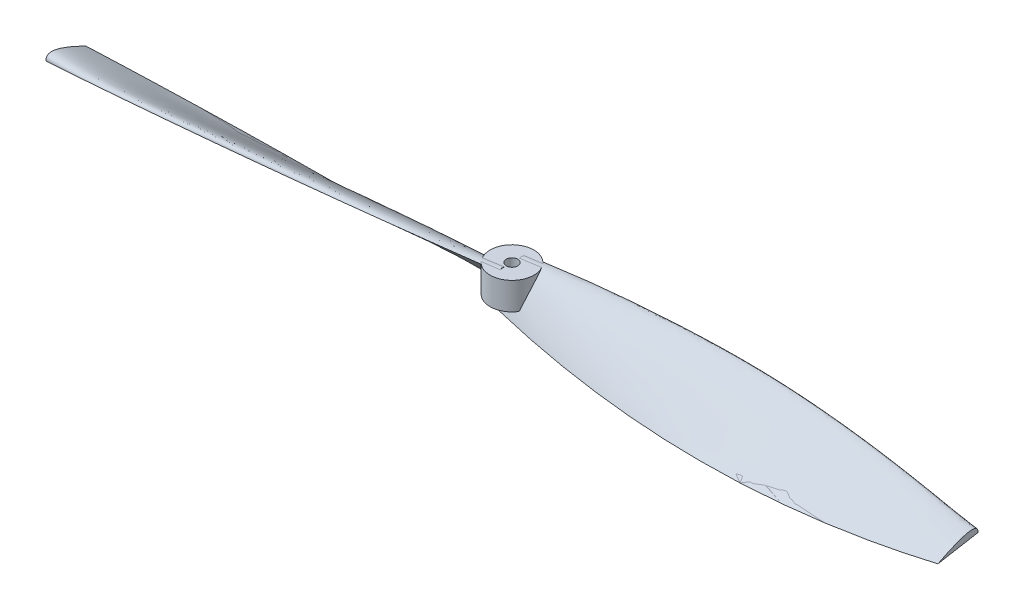
ISO-10303-21;
HEADER;
FILE_DESCRIPTION(('STEP AP214'),'2;1');
FILE_NAME('part.step','',(''),(''),'','','');
FILE_SCHEMA(('AUTOMOTIVE_DESIGN { 1 0 10303 214 1 1 1 1 }'));
ENDSEC;
DATA;
#1=APPLICATION_CONTEXT('core data for automotive mechanical design processes');
#2=APPLICATION_PROTOCOL_DEFINITION('international standard','automotive_design',2000,#1);
#3=PRODUCT_CONTEXT('',#1,'mechanical');
#4=PRODUCT('Part','Part','',(#3));
#5=PRODUCT_RELATED_PRODUCT_CATEGORY('part','',(#4));
#6=PRODUCT_DEFINITION_FORMATION('','',#4);
#7=PRODUCT_DEFINITION_CONTEXT('part definition',#1,'design');
#8=PRODUCT_DEFINITION('design','',#6,#7);
#9=PRODUCT_DEFINITION_SHAPE('','',#8);
#10=(LENGTH_UNIT() NAMED_UNIT(*) SI_UNIT(.MILLI.,.METRE.));
#11=(NAMED_UNIT(*) PLANE_ANGLE_UNIT() SI_UNIT($,.RADIAN.));
#12=(NAMED_UNIT(*) SI_UNIT($,.STERADIAN.) SOLID_ANGLE_UNIT());
#13=UNCERTAINTY_MEASURE_WITH_UNIT(LENGTH_MEASURE(1.E-05),#10,'distance_accuracy_value','');
#14=(GEOMETRIC_REPRESENTATION_CONTEXT(3) GLOBAL_UNCERTAINTY_ASSIGNED_CONTEXT((#13)) GLOBAL_UNIT_ASSIGNED_CONTEXT((#10,
#11,#12)) REPRESENTATION_CONTEXT('',''));
#15=CARTESIAN_POINT('',(0.,0.,0.));
#16=DIRECTION('',(0.,0.,1.));
#17=DIRECTION('',(1.,0.,0.));
#18=AXIS2_PLACEMENT_3D('',#15,#16,#17);
#19=CARTESIAN_POINT('',(0.,14.25,0.));
#20=DIRECTION('',(0.,-1.,0.));
#21=DIRECTION('',(0.,0.,-1.));
#22=AXIS2_PLACEMENT_3D('',#19,#20,#21);
#23=CYLINDRICAL_SURFACE('',#22,6.);
#24=CARTESIAN_POINT('',(0.,6.74999999999999,0.));
#25=DIRECTION('',(0.,1.,0.));
#26=DIRECTION('',(0.,0.,1.));
#27=AXIS2_PLACEMENT_3D('',#24,#25,#26);
#28=CIRCLE('',#27,6.);
#29=CARTESIAN_POINT('',(5.72632907944256,6.74999999999999,1.79141153114816));
#30=VERTEX_POINT('',#29);
#31=CARTESIAN_POINT('',(-5.10437476893727,6.74999999999998,-3.15362620141268));
#32=VERTEX_POINT('',#31);
#33=EDGE_CURVE('E88',#30,#32,#28,.T.);
#34=ORIENTED_EDGE('',*,*,#33,.T.);
#35=CARTESIAN_POINT('',(-5.10437476893727,6.74999999999999,-3.15362620141268));
#36=CARTESIAN_POINT('',(-5.16026535008511,6.97187484248833,-3.06311805262107));
#37=CARTESIAN_POINT('',(-5.21437061560299,7.19323934902174,-2.9702049811467));
#38=CARTESIAN_POINT('',(-5.31914299836333,7.63636326335315,-2.77828116665444));
#39=CARTESIAN_POINT('',(-5.36977866161957,7.85811130531482,-2.67922706985907));
#40=CARTESIAN_POINT('',(-5.46706086409039,8.30086659954444,-2.47469466210765));
#41=CARTESIAN_POINT('',(-5.51368706787035,8.5218651734815,-2.36918777145804));
#42=CARTESIAN_POINT('',(-5.60229404467013,8.9619459412123,-2.15131706587803));
#43=CARTESIAN_POINT('',(-5.64426592332326,9.1810237533016,-2.03894073797795));
#44=CARTESIAN_POINT('',(-5.72446418790607,9.62524306307749,-1.80189279903197));
#45=CARTESIAN_POINT('',(-5.76246206253866,9.85025757530668,-1.6769041521705));
#46=CARTESIAN_POINT('',(-5.83156715255537,10.2956264915081,-1.41800886649211));
#47=CARTESIAN_POINT('',(-5.86268746310122,10.5159890163052,-1.2841198181836));
#48=CARTESIAN_POINT('',(-5.91670212560073,10.9505708829495,-1.00629084339681));
#49=CARTESIAN_POINT('',(-5.9396170310239,11.1648043197478,-0.862377124199787));
#50=CARTESIAN_POINT('',(-5.97544208783538,11.5854970203234,-0.562882902841524));
#51=CARTESIAN_POINT('',(-5.9883668093337,11.7919671863754,-0.407319755562942));
#52=CARTESIAN_POINT('',(-5.99849978760018,12.0995854032452,-0.159201246937015));
#53=CARTESIAN_POINT('',(-6.000244165563,12.2045139395074,-0.0715007481914571));
#54=CARTESIAN_POINT('',(-5.99970037752664,12.4108859425943,0.107983189597482));
#55=CARTESIAN_POINT('',(-5.99741106757419,12.5123284124528,0.199767779692551));
#56=CARTESIAN_POINT('',(-5.98823198876936,12.7103240384298,0.387054925852081));
#57=CARTESIAN_POINT('',(-5.98137116717748,12.8069038722237,0.482530548925636));
#58=CARTESIAN_POINT('',(-5.96238772641909,12.9948926230049,0.677910527899826));
#59=CARTESIAN_POINT('',(-5.95026709511729,13.0863034787905,0.777813197870768));
#60=CARTESIAN_POINT('',(-5.91997863787679,13.2627454218555,0.982091983614635));
#61=CARTESIAN_POINT('',(-5.9018168221894,13.3477827474076,1.08646356379825));
#62=CARTESIAN_POINT('',(-5.85849560604266,13.510341052096,1.29996716467022));
#63=CARTESIAN_POINT('',(-5.83332070717251,13.5878448650322,1.40910927224615));
#64=CARTESIAN_POINT('',(-5.78137405716315,13.7176130813624,1.60742644275151));
#65=CARTESIAN_POINT('',(-5.75613052224915,13.7717073764304,1.69580318726084));
#66=CARTESIAN_POINT('',(-5.70037043879522,13.8731750506809,1.87471298480134));
#67=CARTESIAN_POINT('',(-5.66985579671348,13.9205508485727,1.96524524805121));
#68=CARTESIAN_POINT('',(-5.6032795288245,14.0075959927781,2.14771232321506));
#69=CARTESIAN_POINT('',(-5.56723005880085,14.0472818061674,2.23964367314907));
#70=CARTESIAN_POINT('',(-5.48935727601871,14.1182487981115,2.42424703424459));
#71=CARTESIAN_POINT('',(-5.44753848664069,14.149536505061,2.51691841208523));
#72=CARTESIAN_POINT('',(-5.37762502798609,14.1914940108593,2.66167538168653));
#73=CARTESIAN_POINT('',(-5.35149174876464,14.2052068613803,2.71384783776651));
#74=CARTESIAN_POINT('',(-5.29743039972128,14.2297614259152,2.81792015023148));
#75=CARTESIAN_POINT('',(-5.26950278614056,14.2406038662194,2.86982007231092));
#76=CARTESIAN_POINT('',(-5.2406898709,14.2500000000022,2.92150127110123));
#77=B_SPLINE_CURVE_WITH_KNOTS('',3,(#35,#36,#37,#38,#39,#40,#41,#42,#43,#44,#45,#46,#47,#48,#49,
#50,#51,#52,#53,#54,#55,#56,#57,#58,#59,#60,#61,#62,#63,#64,#65,#66,#67,#68,#69,#70,#71,#72,#73,
#74,#75,#76),.UNSPECIFIED.,.F.,.F.,(4,2,2,2,2,2,2,2,2,2,2,2,2,2,2,2,2,2,2,2,4),(0.,
0.738179606106857,1.48234789900786,2.23009169046389,2.97924064481127,3.75956081422782,
4.53838217062849,5.31523880463482,6.090960288759,6.50111975102514,6.91139555317397,
7.31909782848978,7.72664615297206,8.13379022262737,8.54184128841531,8.86146791558193,
9.18097918106404,9.49979850578473,9.81836926897085,9.99810593282876,10.1777970749565),.UNSPECIFIED.);
#78=CARTESIAN_POINT('',(-5.24068987089982,14.2500000000012,2.92150127110144));
#79=VERTEX_POINT('',#78);
#80=EDGE_CURVE('E428',#32,#79,#77,.T.);
#81=ORIENTED_EDGE('',*,*,#80,.T.);
#82=CARTESIAN_POINT('',(0.,14.25,0.));
#83=DIRECTION('',(0.,1.,0.));
#84=DIRECTION('',(0.,0.,1.));
#85=AXIS2_PLACEMENT_3D('',#82,#83,#84);
#86=CIRCLE('',#85,6.);
#87=CARTESIAN_POINT('',(4.48745468432535,14.25,-3.98280685649285));
#88=VERTEX_POINT('',#87);
#89=EDGE_CURVE('E424',#88,#79,#86,.T.);
#90=ORIENTED_EDGE('',*,*,#89,.F.);
#91=CARTESIAN_POINT('',(3.95496399735066,14.1319443424082,-4.51201283017459));
#92=CARTESIAN_POINT('',(3.98635361460913,14.1386763402429,-4.48449792932467));
#93=CARTESIAN_POINT('',(4.01743542943091,14.1455780023591,-4.456674790916));
#94=CARTESIAN_POINT('',(4.07896876487723,14.1595040033272,-4.40042626536053));
#95=CARTESIAN_POINT('',(4.10942082646511,14.1665282264444,-4.37200144149664));
#96=CARTESIAN_POINT('',(4.16972189140378,14.1804922081533,-4.31452812202806));
#97=CARTESIAN_POINT('',(4.19957117588108,14.1874320054901,-4.28547993083177));
#98=CARTESIAN_POINT('',(4.25868988019194,14.2010543734255,-4.22673599143742));
#99=CARTESIAN_POINT('',(4.28795926286666,14.2077369275661,-4.19704020199713));
#100=CARTESIAN_POINT('',(4.34592940698311,14.2206861192141,-4.13698442221237));
#101=CARTESIAN_POINT('',(4.37462992837241,14.2269525836519,-4.10662416238134));
#102=CARTESIAN_POINT('',(4.43147136907006,14.2389304586591,-4.04522102383618));
#103=CARTESIAN_POINT('',(4.45961171473076,14.2446413214006,-4.01417750766817));
#104=CARTESIAN_POINT('',(4.48745468431684,14.2500000000002,-3.98280685650244));
#105=B_SPLINE_CURVE_WITH_KNOTS('',3,(#91,#92,#93,#94,#95,#96,#97,#98,#99,#100,#101,#102,#103,
#104),.UNSPECIFIED.,.F.,.F.,(4,2,2,2,2,2,4),(0.,0.126839808348723,0.253565709328281,
0.380231074524724,0.506904530084014,0.633630348668267,0.760479879770329),.UNSPECIFIED.);
#106=CARTESIAN_POINT('',(3.95496399735066,14.1319443424082,-4.51201283017459));
#107=VERTEX_POINT('',#106);
#108=EDGE_CURVE('E273',#107,#88,#105,.T.);
#109=ORIENTED_EDGE('',*,*,#108,.F.);
#110=CARTESIAN_POINT('',(5.72632907944255,6.74999999999998,1.79141153114816));
#111=CARTESIAN_POINT('',(5.76408033438215,6.88582967893701,1.67072268002294));
#112=CARTESIAN_POINT('',(5.79786000548766,7.02213501736114,1.54937018642506));
#113=CARTESIAN_POINT('',(5.85756249907767,7.2955379263298,1.30564754350709));
#114=CARTESIAN_POINT('',(5.8834858717236,7.43263544071428,1.18327746606333));
#115=CARTESIAN_POINT('',(5.94959316570311,7.84481324875074,0.815162816663424));
#116=CARTESIAN_POINT('',(5.97813970315377,8.12087098224577,0.568331699478599));
#117=CARTESIAN_POINT('',(6.00475058319476,8.67652189621542,0.0722502507588385));
#118=CARTESIAN_POINT('',(6.00254859395401,8.95612498187862,-0.177002507022009));
#119=CARTESIAN_POINT('',(5.96728096926239,9.51528420310495,-0.673397532815604));
#120=CARTESIAN_POINT('',(5.93421478602461,9.79484033774671,-0.920539763291519));
#121=CARTESIAN_POINT('',(5.83690211451162,10.354625877631,-1.41201468090252));
#122=CARTESIAN_POINT('',(5.7724331652056,10.6348456734679,-1.65631439444111));
#123=CARTESIAN_POINT('',(5.61199628186889,11.1925943705119,-2.1377291170581));
#124=CARTESIAN_POINT('',(5.51602098262161,11.4701226268866,-2.37484243200633));
#125=CARTESIAN_POINT('',(5.29270436600681,12.0193510335346,-2.83778242128842));
#126=CARTESIAN_POINT('',(5.16552494765612,12.2910736362882,-3.06366033546086));
#127=CARTESIAN_POINT('',(4.8789270435155,12.8279389649945,-3.50208290328209));
#128=CARTESIAN_POINT('',(4.71953795240674,13.09308744459,-3.71463948397088));
#129=CARTESIAN_POINT('',(4.45416842884028,13.4859980955932,-4.02232836389572));
#130=CARTESIAN_POINT('',(4.3604766475016,13.6171913108404,-4.12379587816022));
#131=CARTESIAN_POINT('',(4.16433437074133,13.8767796986362,-4.32177083416858));
#132=CARTESIAN_POINT('',(4.06188248510141,14.0051744229952,-4.4182774847235));
#133=CARTESIAN_POINT('',(3.95496399735066,14.1319443424082,-4.51201283017459));
#134=B_SPLINE_CURVE_WITH_KNOTS('',3,(#110,#111,#112,#113,#114,#115,#116,#117,#118,#119,#120,
#121,#122,#123,#124,#125,#126,#127,#128,#129,#130,#131,#132,#133),.UNSPECIFIED.,.F.,.F.,(4,2,2,
2,2,2,2,2,2,2,2,4),(0.,0.556648892248995,1.11325879443831,2.22610168346984,3.34858952150785,
4.47109728217342,5.60167528981759,6.73251778029464,7.85761269337896,8.98168543978498,
9.55289538853634,10.1241961564897),.UNSPECIFIED.);
#135=EDGE_CURVE('E414',#30,#107,#134,.T.);
#136=ORIENTED_EDGE('',*,*,#135,.F.);
#137=EDGE_LOOP('',(#34,#81,#90,#109,#136));
#138=FACE_BOUND('',#137,.T.);
#139=ADVANCED_FACE('F62',(#138),#23,.T.);
#140=CARTESIAN_POINT('',(0.,13.7067490814628,-1.12664688994492));
#141=DIRECTION('',(1.,0.,0.));
#142=DIRECTION('',(0.,1.,0.));
#143=AXIS2_PLACEMENT_3D('',#140,#141,#142);
#144=PLANE('',#143);
#145=DIRECTION('',(0.,0.,1.));
#146=VECTOR('',#145,1.);
#147=CARTESIAN_POINT('',(-5.09544195369075E-13,6.74999999999999,-1.12664688994492));
#148=LINE('',#147,#146);
#149=CARTESIAN_POINT('',(0.,6.74999999999999,1.77793498952051));
#150=VERTEX_POINT('',#149);
#151=CARTESIAN_POINT('',(-6.39480637139913E-13,6.74999999999999,2.7355659523255));
#152=VERTEX_POINT('',#151);
#153=EDGE_CURVE('E383',#150,#152,#148,.T.);
#154=ORIENTED_EDGE('',*,*,#153,.F.);
#155=CARTESIAN_POINT('',(0.,14.0584355167066,-3.90091693224477));
#156=CARTESIAN_POINT('',(0.,4.51687756272044,3.51313147794718));
#157=B_SPLINE_CURVE_WITH_KNOTS('',1,(#155,#156),.UNSPECIFIED.,.F.,.F.,(2,2),(0.,1.),.UNSPECIFIED.);
#158=CARTESIAN_POINT('',(0.,4.5168775627204,3.5131314779472));
#159=VERTEX_POINT('',#158);
#160=EDGE_CURVE('E333',#150,#159,#157,.T.);
#161=ORIENTED_EDGE('',*,*,#160,.T.);
#162=CARTESIAN_POINT('',(0.,14.0584355167066,-3.90091693224477));
#163=CARTESIAN_POINT('',(0.,14.4872984936383,-2.64812471884785));
#164=CARTESIAN_POINT('',(0.,15.8722613637868,-0.227005169572741));
#165=CARTESIAN_POINT('',(0.,4.5168775627204,3.5131314779472));
#166=B_SPLINE_CURVE_WITH_KNOTS('',3,(#162,#163,#164,#165),.UNSPECIFIED.,.F.,.F.,(4,4),(0.,1.),.UNSPECIFIED.);
#167=EDGE_CURVE('E337',#152,#159,#166,.T.);
#168=ORIENTED_EDGE('',*,*,#167,.F.);
#169=EDGE_LOOP('',(#154,#161,#168));
#170=FACE_BOUND('',#169,.T.);
#171=ADVANCED_FACE('F284',(#170),#144,.F.);
#172=CARTESIAN_POINT('',(0.,14.0584355167066,-3.90091693224477));
#173=CARTESIAN_POINT('',(20.0163613845974,14.488211674464,-7.07602997354054));
#174=CARTESIAN_POINT('',(59.9933725801323,13.5934025627138,-10.9182818600998));
#175=CARTESIAN_POINT('',(100.016361384597,9.17942540515399,-9.74984596442364));
#176=CARTESIAN_POINT('',(120.,6.0952561127416,-7.91164091856942));
#177=CARTESIAN_POINT('',(0.,14.4872984936383,-2.64812471884785));
#178=CARTESIAN_POINT('',(20.011637464951,13.9857753783964,-3.7486819429666));
#179=CARTESIAN_POINT('',(59.9980964999185,21.7663283521157,-12.2435260702604));
#180=CARTESIAN_POINT('',(100.011637464951,9.94020444360194,-8.30165373242463));
#181=CARTESIAN_POINT('',(120.,8.63272193477932,-8.1401945865525));
#182=CARTESIAN_POINT('',(0.,15.8722613637868,-0.227005169572741));
#183=CARTESIAN_POINT('',(20.0069135453046,14.4394389755456,0.746993423485537));
#184=CARTESIAN_POINT('',(60.0028204197048,-4.98079442512257,11.5994111827611));
#185=CARTESIAN_POINT('',(100.006913545305,7.51916087378821,-2.96012861079376));
#186=CARTESIAN_POINT('',(120.,7.98836514855535,-4.47541536490372));
#187=CARTESIAN_POINT('',(0.,4.5168775627204,3.5131314779472));
#188=CARTESIAN_POINT('',(20.0021896256583,2.15275590147992,6.5616858881825));
#189=CARTESIAN_POINT('',(60.007544339491,-0.270490450584237,9.53848986965222));
#190=CARTESIAN_POINT('',(100.002189625658,1.9162946957128,6.27472940046898));
#191=CARTESIAN_POINT('',(120.,4.16218575406971,3.08269674637692));
#192=B_SPLINE_SURFACE_WITH_KNOTS('',3,3,((#172,#173,#174,#175,#176),(#177,#178,#179,#180,#181),
(#182,#183,#184,#185,#186),(#187,#188,#189,#190,#191)),.UNSPECIFIED.,.F.,.F.,.F.,(4,4),(4,1,4),
(0.,1.),(0.,0.499939162718313,1.),.UNSPECIFIED.);
#193=CARTESIAN_POINT('',(0.,14.0584355167066,-3.90091693224477));
#194=CARTESIAN_POINT('',(20.0163613845974,14.488211674464,-7.07602997354054));
#195=CARTESIAN_POINT('',(59.9933725801323,13.5934025627138,-10.9182818600998));
#196=CARTESIAN_POINT('',(100.016361384597,9.17942540515399,-9.74984596442364));
#197=CARTESIAN_POINT('',(120.,6.0952561127416,-7.91164091856942));
#198=B_SPLINE_CURVE_WITH_KNOTS('',3,(#193,#194,#195,#196,#197),.UNSPECIFIED.,.F.,.F.,(4,1,4),
(0.,0.499939162718313,1.),.UNSPECIFIED.);
#199=CARTESIAN_POINT('',(120.,6.0952561127416,-7.91164091856942));
#200=VERTEX_POINT('',#199);
#201=EDGE_CURVE('E391',#200,#107,#198,.F.);
#202=CARTESIAN_POINT('',(0.,14.2500000002678,-3.33180246985601));
#203=CARTESIAN_POINT('',(0.308947528238749,14.2500000000965,-3.37090128165485));
#204=CARTESIAN_POINT('',(0.617806901648823,14.2500000000259,-3.4107229450084));
#205=CARTESIAN_POINT('',(1.23532026544638,14.249999999974,-3.49234228065914));
#206=CARTESIAN_POINT('',(1.54397420903937,14.2499999999927,-3.53414030622245));
#207=CARTESIAN_POINT('',(2.19167471300583,14.250000000008,-3.62451808600509));
#208=CARTESIAN_POINT('',(2.53068514369679,14.2500000000021,-3.67335859079351));
#209=CARTESIAN_POINT('',(3.20813808449926,14.2499999999978,-3.77484807753751));
#210=CARTESIAN_POINT('',(3.54658059514873,14.2499999999994,-3.82749705588338));
#211=CARTESIAN_POINT('',(4.2226977187318,14.2500000000006,-3.93730865257808));
#212=CARTESIAN_POINT('',(4.56037241039552,14.2500000000001,-3.99447078450169));
#213=CARTESIAN_POINT('',(5.23485785473513,14.2499999999998,-4.11366766308743));
#214=CARTESIAN_POINT('',(5.57166861765104,14.25,-4.17570235171771));
#215=CARTESIAN_POINT('',(5.96271267794377,14.25,-4.25039150154578));
#216=CARTESIAN_POINT('',(6.0173619743321,14.25,-4.26089010329129));
#217=CARTESIAN_POINT('',(6.07199999999999,14.25,-4.27144621971413));
#218=B_SPLINE_CURVE_WITH_KNOTS('',3,(#202,#203,#204,#205,#206,#207,#208,#209,#210,#211,#212,
#213,#214,#215,#216,#217),.UNSPECIFIED.,.F.,.F.,(4,2,2,2,2,2,2,4),(0.,0.934239358767292,
1.86864634472526,2.89616045542525,3.92367359225093,4.95107613506002,5.97846644342163,
6.14541206268552),.UNSPECIFIED.);
#219=CARTESIAN_POINT('',(1.13295166650948E-13,14.25,-3.33178832180172));
#220=VERTEX_POINT('',#219);
#221=EDGE_CURVE('E327',#220,#88,#218,.T.);
#222=CARTESIAN_POINT('',(0.,14.2500000000012,-2.07291422027532));
#223=VERTEX_POINT('',#222);
#224=EDGE_CURVE('E371',#220,#223,#166,.T.);
#225=CARTESIAN_POINT('',(6.072,14.25,-3.06496839383052));
#226=CARTESIAN_POINT('',(5.76502592579285,14.25,-3.01255322358199));
#227=CARTESIAN_POINT('',(5.45818532964106,14.25,-2.9593710704008));
#228=CARTESIAN_POINT('',(4.84454359855457,14.25,-2.85254843435641));
#229=CARTESIAN_POINT('',(4.53774247354585,14.25,-2.79890789427444));
#230=CARTESIAN_POINT('',(3.89682639598321,14.25,-2.68753057523477));
#231=CARTESIAN_POINT('',(3.56270122803168,14.25,-2.62985222814521));
#232=CARTESIAN_POINT('',(2.89410280041867,14.25,-2.51653643408501));
#233=CARTESIAN_POINT('',(2.55962954116565,14.2499999999999,-2.46089898472235));
#234=CARTESIAN_POINT('',(1.89022471730496,14.2500000000001,-2.3526473786937));
#235=CARTESIAN_POINT('',(1.55529319940875,14.2500000000003,-2.30003293442917));
#236=CARTESIAN_POINT('',(0.884877236612951,14.2499999999996,-2.1984585532553));
#237=CARTESIAN_POINT('',(0.549392797876052,14.2499999999986,-2.14949857589213));
#238=CARTESIAN_POINT('',(0.142433962477597,14.2500000000003,-2.09256565514907));
#239=CARTESIAN_POINT('',(0.0712231760668968,14.2500000000007,-2.08269448482434));
#240=CARTESIAN_POINT('',(0.,14.2500000000012,-2.07291422027532));
#241=B_SPLINE_CURVE_WITH_KNOTS('',3,(#225,#226,#227,#228,#229,#230,#231,#232,#233,#234,#235,
#236,#237,#238,#239,#240),.UNSPECIFIED.,.F.,.F.,(4,2,2,2,2,2,2,4),(0.,0.934246581126546,
1.86861153573067,2.88581000772306,3.90300728747864,4.92010763371902,5.93719671930411,
6.15287157847137),.UNSPECIFIED.);
#242=CARTESIAN_POINT('',(5.24068987090692,14.25,-2.92150127108882));
#243=VERTEX_POINT('',#242);
#244=EDGE_CURVE('E325',#243,#223,#241,.T.);
#245=CARTESIAN_POINT('',(5.24068987090694,14.25,-2.92150127108879));
#246=CARTESIAN_POINT('',(5.27879622089331,14.2375919814024,-2.85316328473129));
#247=CARTESIAN_POINT('',(5.31534897398897,14.2226271591561,-2.78443259098668));
#248=CARTESIAN_POINT('',(5.38527263166832,14.1877128995665,-2.64665360572634));
#249=CARTESIAN_POINT('',(5.4186447684657,14.1677654035124,-2.57760544815722));
#250=CARTESIAN_POINT('',(5.48200294403274,14.1231172275384,-2.4399516772292));
#251=CARTESIAN_POINT('',(5.51200513110795,14.0984408968128,-2.3713455816076));
#252=CARTESIAN_POINT('',(5.56883606265666,14.0445375884975,-2.23462428787189));
#253=CARTESIAN_POINT('',(5.59566490382589,14.0153107496303,-2.1665090748594));
#254=CARTESIAN_POINT('',(5.65725080212879,13.9389517867875,-2.00156937819742));
#255=CARTESIAN_POINT('',(5.69036926594514,13.8895665322431,-1.90516663933662));
#256=CARTESIAN_POINT('',(5.7506111358181,13.7831454285936,-1.71477361575732));
#257=CARTESIAN_POINT('',(5.77773238973691,13.7261068448015,-1.62078420773821));
#258=CARTESIAN_POINT('',(5.86607437827866,13.5075168237021,-1.28541579112769));
#259=CARTESIAN_POINT('',(5.91125456232682,13.3265030050905,-1.05223741346436));
#260=CARTESIAN_POINT('',(5.95781719814713,13.0333734587562,-0.719075173399648));
#261=CARTESIAN_POINT('',(5.96980698844766,12.9317494631882,-0.61051036817483));
#262=CARTESIAN_POINT('',(5.98768313298875,12.7226123156278,-0.398662566224905));
#263=CARTESIAN_POINT('',(5.99357158739792,12.6151012034916,-0.295377763691579));
#264=CARTESIAN_POINT('',(6.00092142373295,12.3682711831115,-0.0689899154122294));
#265=CARTESIAN_POINT('',(6.00093333312695,12.2276454369941,0.0527207983403895));
#266=CARTESIAN_POINT('',(5.99419738067788,11.9406089565534,0.289096622206095));
#267=CARTESIAN_POINT('',(5.98744416776449,11.7941937309307,0.403756078721771));
#268=CARTESIAN_POINT('',(5.96823752679683,11.4968420609963,0.626620172295179));
#269=CARTESIAN_POINT('',(5.95578206583671,11.3459040222085,0.734822491758168));
#270=CARTESIAN_POINT('',(5.9259658012755,11.0399750343151,0.945673778938791));
#271=CARTESIAN_POINT('',(5.90858944233134,10.8849726705929,1.04830388632944));
#272=CARTESIAN_POINT('',(5.86962545065933,10.5721464324479,1.24813987280937));
#273=CARTESIAN_POINT('',(5.84803978870251,10.414323909697,1.34534826302981));
#274=CARTESIAN_POINT('',(5.80118159167785,10.0963376033895,1.53486722047788));
#275=CARTESIAN_POINT('',(5.7759094580875,9.9361740764882,1.62717831955707));
#276=CARTESIAN_POINT('',(5.72146193421596,9.61012144037976,1.80945606725318));
#277=CARTESIAN_POINT('',(5.69220879703956,9.44418621497791,1.89931669932335));
#278=CARTESIAN_POINT('',(5.63062754161358,9.11062621500135,2.074771529173));
#279=CARTESIAN_POINT('',(5.59829914934963,8.94300129106139,2.16036534572898));
#280=CARTESIAN_POINT('',(5.53084311039145,8.6063368360479,2.32764006453422));
#281=CARTESIAN_POINT('',(5.49571500149419,8.43729707553985,2.40932031711758));
#282=CARTESIAN_POINT('',(5.42338280558358,8.10039887883937,2.56795851874398));
#283=CARTESIAN_POINT('',(5.38621388930428,7.93255614099832,2.64496594427186));
#284=CARTESIAN_POINT('',(5.30954193644462,7.5959786670821,2.79569645232152));
#285=CARTESIAN_POINT('',(5.27003938792823,7.42724412419666,2.86942021598225));
#286=CARTESIAN_POINT('',(5.18883314298775,7.08910768856889,3.01377495455976));
#287=CARTESIAN_POINT('',(5.14713077698634,6.91970625524578,3.0844077526136));
#288=CARTESIAN_POINT('',(5.10437476893727,6.74999999999999,3.15362620141268));
#289=B_SPLINE_CURVE_WITH_KNOTS('',3,(#245,#246,#247,#248,#249,#250,#251,#252,#253,#254,#255,
#256,#257,#258,#259,#260,#261,#262,#263,#264,#265,#266,#267,#268,#269,#270,#271,#272,#273,#274,
#275,#276,#277,#278,#279,#280,#281,#282,#283,#284,#285,#286,#287,#288),.UNSPECIFIED.,.F.,.F.,(4,
2,2,2,2,2,2,2,2,2,2,2,2,2,2,2,2,2,2,2,2,4),(0.,0.237597475063558,0.475102524270431,
0.711415992113114,0.947722257339663,1.28698529075194,1.62636987404262,2.51621757710614,
2.96363438112423,3.41089712655382,3.9684347536528,4.52641372984173,5.08459178595499,
5.64455436825751,6.20425540609968,6.7638955347962,7.33668244587754,7.90952044187036,
8.4824532039127,9.04751103603531,9.61245110552841,10.1770533383583),.UNSPECIFIED.);
#290=CARTESIAN_POINT('',(5.10437476893367,6.74999999999999,3.15362620141852));
#291=VERTEX_POINT('',#290);
#292=EDGE_CURVE('E313',#243,#291,#289,.T.);
#293=CARTESIAN_POINT('',(6.072,6.74999999999999,3.22326559761972));
#294=CARTESIAN_POINT('',(5.05919906177773,6.75000000000242,3.15195393305669));
#295=CARTESIAN_POINT('',(4.04679859266659,6.75000000000242,3.07565632998078));
#296=CARTESIAN_POINT('',(2.02279859266659,6.74999999999756,2.9130892468032));
#297=CARTESIAN_POINT('',(1.01119906177773,6.7499999999927,2.82681976670153));
#298=CARTESIAN_POINT('',(0.,6.74999999998541,2.73556434808698));
#299=B_SPLINE_CURVE_WITH_KNOTS('',3,(#293,#294,#295,#296,#297,#298),.UNSPECIFIED.,.F.,.F.,(4,2,
4),(0.,3.04581422723452,6.09162845446904),.UNSPECIFIED.);
#300=EDGE_CURVE('E271',#291,#152,#299,.T.);
#301=CARTESIAN_POINT('',(0.,4.5168775627204,3.5131314779472));
#302=CARTESIAN_POINT('',(20.0021896256583,2.15275590147992,6.5616858881825));
#303=CARTESIAN_POINT('',(60.007544339491,-0.270490450584237,9.53848986965222));
#304=CARTESIAN_POINT('',(100.002189625658,1.9162946957128,6.27472940046898));
#305=CARTESIAN_POINT('',(120.,4.16218575406971,3.08269674637692));
#306=B_SPLINE_CURVE_WITH_KNOTS('',3,(#301,#302,#303,#304,#305),.UNSPECIFIED.,.F.,.F.,(4,1,4),
(0.,0.499939162718313,1.),.UNSPECIFIED.);
#307=CARTESIAN_POINT('',(120.,4.16218575406971,3.08269674637692));
#308=VERTEX_POINT('',#307);
#309=EDGE_CURVE('E338',#159,#308,#306,.T.);
#310=CARTESIAN_POINT('',(120.,6.0952561127416,-7.91164091856942));
#311=CARTESIAN_POINT('',(120.,9.90145484579818,-8.25447142054404));
#312=CARTESIAN_POINT('',(120.,4.16218575406971,3.08269674637692));
#313=B_SPLINE_CURVE_WITH_KNOTS('',2,(#310,#311,#312),.UNSPECIFIED.,.F.,.F.,(3,3),(0.,1.),.UNSPECIFIED.);
#314=EDGE_CURVE('E393',#200,#308,#313,.T.);
#315=ORIENTED_EDGE('',*,*,#201,.T.);
#316=ORIENTED_EDGE('',*,*,#108,.T.);
#317=ORIENTED_EDGE('',*,*,#221,.F.);
#318=ORIENTED_EDGE('',*,*,#224,.T.);
#319=ORIENTED_EDGE('',*,*,#244,.F.);
#320=ORIENTED_EDGE('',*,*,#292,.T.);
#321=ORIENTED_EDGE('',*,*,#300,.T.);
#322=ORIENTED_EDGE('',*,*,#167,.T.);
#323=ORIENTED_EDGE('',*,*,#309,.T.);
#324=ORIENTED_EDGE('',*,*,#314,.F.);
#325=EDGE_LOOP('',(#315,#316,#317,#318,#319,#320,#321,#322,#323,#324));
#326=FACE_BOUND('',#325,.T.);
#327=ADVANCED_FACE('F278',(#326),#192,.T.);
#328=CARTESIAN_POINT('',(0.,4.51687756272044,3.51313147794718));
#329=CARTESIAN_POINT('',(20.0021896256583,2.15275590147994,6.56168588818249));
#330=CARTESIAN_POINT('',(60.007544339491,-0.270490450584244,9.53848986965222));
#331=CARTESIAN_POINT('',(100.002189625658,1.9162946957128,6.27472940046897));
#332=CARTESIAN_POINT('',(120.,4.16218575406972,3.08269674637689));
#333=CARTESIAN_POINT('',(0.,7.69739688071583,1.0417820078832));
#334=CARTESIAN_POINT('',(20.0069135453046,6.26457449247463,2.01578060094148));
#335=CARTESIAN_POINT('',(60.0028204197048,4.3508072205151,2.71956595973487));
#336=CARTESIAN_POINT('',(100.006913545305,4.33733826552653,0.933204278838096));
#337=CARTESIAN_POINT('',(120.,4.80654254029368,-0.58208247527188));
#338=CARTESIAN_POINT('',(0.,10.8779161987112,-1.42956746218079));
#339=CARTESIAN_POINT('',(20.011637464951,10.3763930834693,-2.53012468629953));
#340=CARTESIAN_POINT('',(59.9980964999185,8.97210489161444,-4.09935795018248));
#341=CARTESIAN_POINT('',(100.011637464951,6.75838183534026,-4.40832084279277));
#342=CARTESIAN_POINT('',(120.,5.45089932651764,-4.24686169692065));
#343=CARTESIAN_POINT('',(0.,14.0584355167066,-3.90091693224477));
#344=CARTESIAN_POINT('',(20.0163613845974,14.488211674464,-7.07602997354054));
#345=CARTESIAN_POINT('',(59.9933725801323,13.5934025627138,-10.9182818600998));
#346=CARTESIAN_POINT('',(100.016361384597,9.17942540515399,-9.74984596442365));
#347=CARTESIAN_POINT('',(120.,6.0952561127416,-7.91164091856942));
#348=B_SPLINE_SURFACE_WITH_KNOTS('',3,3,((#328,#329,#330,#331,#332),(#333,#334,#335,#336,#337),
(#338,#339,#340,#341,#342),(#343,#344,#345,#346,#347)),.UNSPECIFIED.,.F.,.F.,.F.,(4,4),(4,1,4),
(0.,1.),(0.,0.499939162718313,1.),.UNSPECIFIED.);
#349=CARTESIAN_POINT('',(0.,6.74999999999999,1.77793498952051));
#350=CARTESIAN_POINT('',(0.337318946636775,6.74999999999999,1.78236907610332));
#351=CARTESIAN_POINT('',(0.6746470047694,6.74999999999999,1.78607993252954));
#352=CARTESIAN_POINT('',(1.34930639844387,6.74999999999999,1.79214312491567));
#353=CARTESIAN_POINT('',(1.68663773365878,6.74999999999999,1.79449549707789));
#354=CARTESIAN_POINT('',(2.36130285120306,6.74999999999999,1.79792986806543));
#355=CARTESIAN_POINT('',(2.69863663346011,6.74999999999999,1.7990118814443));
#356=CARTESIAN_POINT('',(3.37330512443997,6.74999999999999,1.79998417481867));
#357=CARTESIAN_POINT('',(3.71063983315924,6.74999999999999,1.79987445736548));
#358=CARTESIAN_POINT('',(4.38531151160548,6.74999999999999,1.79853635585183));
#359=CARTESIAN_POINT('',(4.72264848130084,6.74999999999999,1.79730795658212));
#360=CARTESIAN_POINT('',(5.39732506122264,6.74999999999999,1.79379810586907));
#361=CARTESIAN_POINT('',(5.73466467131863,6.74999999999999,1.79151662918944));
#362=CARTESIAN_POINT('',(6.072,6.74999999999999,1.78874146348297));
#363=B_SPLINE_CURVE_WITH_KNOTS('',3,(#349,#350,#351,#352,#353,#354,#355,#356,#357,#358,#359,
#360,#361,#362),.UNSPECIFIED.,.F.,.F.,(4,2,2,2,2,2,4),(0.,1.01204291325232,2.02405885528936,
3.03606320329929,4.04806538477234,5.06008132531477,6.0721215193904),.UNSPECIFIED.);
#364=EDGE_CURVE('E413',#150,#30,#363,.T.);
#365=CARTESIAN_POINT('',(120.,4.16218575406972,3.08269674637689));
#366=CARTESIAN_POINT('',(120.,6.0952561127416,-7.91164091856942));
#367=B_SPLINE_CURVE_WITH_KNOTS('',1,(#365,#366),.UNSPECIFIED.,.F.,.F.,(2,2),(0.,1.),.UNSPECIFIED.);
#368=EDGE_CURVE('E390',#308,#200,#367,.T.);
#369=ORIENTED_EDGE('',*,*,#364,.T.);
#370=ORIENTED_EDGE('',*,*,#135,.T.);
#371=ORIENTED_EDGE('',*,*,#201,.F.);
#372=ORIENTED_EDGE('',*,*,#368,.F.);
#373=ORIENTED_EDGE('',*,*,#309,.F.);
#374=ORIENTED_EDGE('',*,*,#160,.F.);
#375=EDGE_LOOP('',(#369,#370,#371,#372,#373,#374));
#376=FACE_BOUND('',#375,.T.);
#377=ADVANCED_FACE('F283',(#376),#348,.T.);
#378=CARTESIAN_POINT('',(120.,7.51508788960191,-5.33447175332015));
#379=DIRECTION('',(-1.,0.,0.));
#380=DIRECTION('',(0.,0.,1.));
#381=AXIS2_PLACEMENT_3D('',#378,#379,#380);
#382=PLANE('',#381);
#383=ORIENTED_EDGE('',*,*,#368,.T.);
#384=ORIENTED_EDGE('',*,*,#314,.T.);
#385=EDGE_LOOP('',(#383,#384));
#386=FACE_BOUND('',#385,.T.);
#387=ADVANCED_FACE('F64',(#386),#382,.F.);
#388=ORIENTED_EDGE('',*,*,#224,.F.);
#389=DIRECTION('',(0.,0.,1.));
#390=VECTOR('',#389,1.);
#391=CARTESIAN_POINT('',(0.,14.25,-1.12664688994492));
#392=LINE('',#391,#390);
#393=EDGE_CURVE('E425',#220,#223,#392,.T.);
#394=ORIENTED_EDGE('',*,*,#393,.T.);
#395=EDGE_LOOP('',(#388,#394));
#396=FACE_BOUND('',#395,.T.);
#397=ADVANCED_FACE('F286',(#396),#144,.F.);
#398=CARTESIAN_POINT('',(-4.48745468431585,14.25,3.98280685650349));
#399=VERTEX_POINT('',#398);
#400=EDGE_CURVE('E429',#399,#243,#86,.T.);
#401=ORIENTED_EDGE('',*,*,#400,.F.);
#402=CARTESIAN_POINT('',(-4.48745468431778,14.2500000000003,3.98280685650139));
#403=CARTESIAN_POINT('',(-4.45961171473165,14.2446413214008,4.01417750766719));
#404=CARTESIAN_POINT('',(-4.4314713690709,14.2389304586592,4.04522102383526));
#405=CARTESIAN_POINT('',(-4.37462992837315,14.2269525836521,4.10662416238055));
#406=CARTESIAN_POINT('',(-4.34592940698381,14.2206861192142,4.13698442221164));
#407=CARTESIAN_POINT('',(-4.28795926286725,14.2077369275663,4.19704020199652));
#408=CARTESIAN_POINT('',(-4.25868988019249,14.2010543734256,4.22673599143687));
#409=CARTESIAN_POINT('',(-4.19957117588152,14.1874320054902,4.28547993083134));
#410=CARTESIAN_POINT('',(-4.16972189140417,14.1804922081534,4.31452812202768));
#411=CARTESIAN_POINT('',(-4.10942082646539,14.1665282264445,4.37200144149637));
#412=CARTESIAN_POINT('',(-4.07896876487746,14.1595040033273,4.40042626536032));
#413=CARTESIAN_POINT('',(-4.01743542943102,14.1455780023591,4.4566747909159));
#414=CARTESIAN_POINT('',(-3.98635361460919,14.1386763402429,4.48449792932462));
#415=CARTESIAN_POINT('',(-3.95496399735066,14.1319443424082,4.51201283017459));
#416=B_SPLINE_CURVE_WITH_KNOTS('',3,(#402,#403,#404,#405,#406,#407,#408,#409,#410,#411,#412,
#413,#414,#415),.UNSPECIFIED.,.F.,.F.,(4,2,2,2,2,2,4),(0.,0.126849531102297,0.253575349686786,
0.380248805246311,0.506914170442989,0.633640071422782,0.760479879771741),.UNSPECIFIED.);
#417=CARTESIAN_POINT('',(-3.95496399735066,14.1319443424082,4.51201283017459));
#418=VERTEX_POINT('',#417);
#419=EDGE_CURVE('E444',#399,#418,#416,.T.);
#420=ORIENTED_EDGE('',*,*,#419,.T.);
#421=CARTESIAN_POINT('',(-3.95496399735066,14.1319443424082,4.51201283017459));
#422=CARTESIAN_POINT('',(-4.04337696260376,14.0271230732465,4.43450731155301));
#423=CARTESIAN_POINT('',(-4.12873568482746,13.9211821832702,4.35509963741773));
#424=CARTESIAN_POINT('',(-4.29343588374723,13.707337423086,4.19282561165011));
#425=CARTESIAN_POINT('',(-4.37277866417089,13.5994339845069,4.10996001546107));
#426=CARTESIAN_POINT('',(-4.60178364712836,13.2733980600391,3.85685474340529));
#427=CARTESIAN_POINT('',(-4.74264389699861,13.0526755176943,3.68191033538949));
#428=CARTESIAN_POINT('',(-5.00102996729644,12.6068076090532,3.32243260410686));
#429=CARTESIAN_POINT('',(-5.1186208768822,12.3816765726283,3.13792790349424));
#430=CARTESIAN_POINT('',(-5.33148881929567,11.9276459973269,2.76081834799356));
#431=CARTESIAN_POINT('',(-5.42675884653927,11.6987452993739,2.56821097233047));
#432=CARTESIAN_POINT('',(-5.68254804562556,10.9999638408908,1.97403420874631));
#433=CARTESIAN_POINT('',(-5.80865177342564,10.5256835278341,1.56236069452087));
#434=CARTESIAN_POINT('',(-5.9711705069602,9.57325513884004,0.725823553321131));
#435=CARTESIAN_POINT('',(-6.00753101992193,9.09510488972613,0.30095207088672));
#436=CARTESIAN_POINT('',(-5.99290195348524,8.30418646000229,-0.40448537419899));
#437=CARTESIAN_POINT('',(-5.96747237134263,7.99062702951921,-0.684851195064217));
#438=CARTESIAN_POINT('',(-5.89949286808167,7.52294014054228,-1.10264937273276));
#439=CARTESIAN_POINT('',(-5.87190700249576,7.36765521903832,-1.24130660991659));
#440=CARTESIAN_POINT('',(-5.80668675275441,7.05804260244817,-1.51739741401775));
#441=CARTESIAN_POINT('',(-5.76904988281718,6.90371515383543,-1.65483066952341));
#442=CARTESIAN_POINT('',(-5.72632907944256,6.74999999999999,-1.79141153114816));
#443=B_SPLINE_CURVE_WITH_KNOTS('',3,(#421,#422,#423,#424,#425,#426,#427,#428,#429,#430,#431,
#432,#433,#434,#435,#436,#437,#438,#439,#440,#441,#442),.UNSPECIFIED.,.F.,.F.,(4,2,2,2,2,2,2,2,
2,2,4),(0.,0.472446719471227,0.944790759622441,1.88829268448139,2.82911692700243,
3.77023606020998,5.68464761045924,7.60022132051077,8.86253378706877,9.49231170338802,
10.122245518815),.UNSPECIFIED.);
#444=CARTESIAN_POINT('',(-5.72632907944256,6.74999999999998,-1.79141153114816));
#445=VERTEX_POINT('',#444);
#446=EDGE_CURVE('E468',#418,#445,#443,.T.);
#447=ORIENTED_EDGE('',*,*,#446,.T.);
#448=EDGE_CURVE('E436',#445,#291,#28,.T.);
#449=ORIENTED_EDGE('',*,*,#448,.T.);
#450=ORIENTED_EDGE('',*,*,#292,.F.);
#451=EDGE_LOOP('',(#401,#420,#447,#449,#450));
#452=FACE_BOUND('',#451,.T.);
#453=ADVANCED_FACE('F249',(#452),#23,.T.);
#454=CARTESIAN_POINT('',(0.,14.25,0.));
#455=DIRECTION('',(0.,1.,0.));
#456=DIRECTION('',(0.,0.,1.));
#457=AXIS2_PLACEMENT_3D('',#454,#455,#456);
#458=PLANE('',#457);
#459=CARTESIAN_POINT('',(0.,14.25,0.));
#460=DIRECTION('',(0.,1.,0.));
#461=DIRECTION('',(0.,0.,1.));
#462=AXIS2_PLACEMENT_3D('',#459,#460,#461);
#463=CIRCLE('',#462,1.5875);
#464=CARTESIAN_POINT('',(0.,14.25,1.5875));
#465=VERTEX_POINT('',#464);
#466=EDGE_CURVE('E519',#465,#465,#463,.T.);
#467=ORIENTED_EDGE('',*,*,#466,.F.);
#468=EDGE_LOOP('',(#467));
#469=FACE_BOUND('',#468,.T.);
#470=CARTESIAN_POINT('',(-6.072,14.25,4.27144621971409));
#471=CARTESIAN_POINT('',(-5.919080017207,14.25,4.24190031652547));
#472=CARTESIAN_POINT('',(-5.76607362781926,14.25,4.21280223998186));
#473=CARTESIAN_POINT('',(-5.45988331092438,14.25,4.15555255843661));
#474=CARTESIAN_POINT('',(-5.30669938271858,14.25,4.12740095717277));
#475=CARTESIAN_POINT('',(-4.8469376748731,14.25,4.04445356359133));
#476=CARTESIAN_POINT('',(-4.54008845773187,14.25,3.99115325468052));
#477=CARTESIAN_POINT('',(-3.9986332793296,14.25,3.90062111448192));
#478=CARTESIAN_POINT('',(-3.76416225108023,14.25,3.86257753979923));
#479=CARTESIAN_POINT('',(-3.29489089236908,14.25,3.7885482309596));
#480=CARTESIAN_POINT('',(-3.0600905552612,14.25,3.75256253896546));
#481=CARTESIAN_POINT('',(-2.59021322042809,14.25,3.68240533415657));
#482=CARTESIAN_POINT('',(-2.35513621531938,14.25,3.64823387093457));
#483=CARTESIAN_POINT('',(-1.76702638896553,14.25,3.56471741015828));
#484=CARTESIAN_POINT('',(-1.41385658234927,14.2499999999998,3.51634013540208));
#485=CARTESIAN_POINT('',(-0.707161550361011,14.2500000000001,3.42226371645364));
#486=CARTESIAN_POINT('',(-0.353636327112923,14.2500000000006,3.37656455635307));
#487=CARTESIAN_POINT('',(0.,14.2500000000017,3.33180247177139));
#488=B_SPLINE_CURVE_WITH_KNOTS('',3,(#470,#471,#472,#473,#474,#475,#476,#477,#478,#479,#480,
#481,#482,#483,#484,#485,#486,#487),.UNSPECIFIED.,.F.,.F.,(4,2,2,2,2,2,2,2,4),(0.,
0.467243325535074,0.934488496081701,1.86879087170798,2.58139370329676,3.29401112977088,
4.00664802593663,5.07603892859121,6.14542347828707),.UNSPECIFIED.);
#489=CARTESIAN_POINT('',(0.,14.2500000000294,3.33179539678869));
#490=VERTEX_POINT('',#489);
#491=EDGE_CURVE('E446',#399,#490,#488,.T.);
#492=ORIENTED_EDGE('',*,*,#491,.F.);
#493=ORIENTED_EDGE('',*,*,#400,.T.);
#494=ORIENTED_EDGE('',*,*,#244,.T.);
#495=ORIENTED_EDGE('',*,*,#393,.F.);
#496=ORIENTED_EDGE('',*,*,#221,.T.);
#497=ORIENTED_EDGE('',*,*,#89,.T.);
#498=CARTESIAN_POINT('',(0.,14.250000000048,2.07291422057318));
#499=CARTESIAN_POINT('',(-0.308581054323907,14.2500000000173,2.11525493020964));
#500=CARTESIAN_POINT('',(-0.616916968850262,14.2500000000047,2.15935221322312));
#501=CARTESIAN_POINT('',(-1.23309597048169,14.2499999999953,2.25069400963173));
#502=CARTESIAN_POINT('',(-1.54093909745017,14.2499999999987,2.29793825375478));
#503=CARTESIAN_POINT('',(-2.20117369263639,14.2500000000015,2.40232901363132));
#504=CARTESIAN_POINT('',(-2.55349568830185,14.2500000000004,2.45991321002747));
#505=CARTESIAN_POINT('',(-3.25770664048829,14.2499999999996,2.57773860931406));
#506=CARTESIAN_POINT('',(-3.60959557855057,14.2499999999999,2.63797992168698));
#507=CARTESIAN_POINT('',(-4.31318544377936,14.2500000000001,2.75970918662005));
#508=CARTESIAN_POINT('',(-4.66488635343768,14.25,2.82119723961425));
#509=CARTESIAN_POINT('',(-5.36833305177382,14.2499999999999,2.94378229312315));
#510=CARTESIAN_POINT('',(-5.72007883619704,14.2499999999999,3.00487931816451));
#511=CARTESIAN_POINT('',(-6.072,14.25,3.06496839383049));
#512=B_SPLINE_CURVE_WITH_KNOTS('',3,(#498,#499,#500,#501,#502,#503,#504,#505,#506,#507,#508,
#509,#510,#511),.UNSPECIFIED.,.F.,.F.,(4,2,2,2,2,2,4),(0.,0.93440601373092,1.86873217676809,
2.93970747536857,4.01072694320307,5.08183303498318,6.15287127146693),.UNSPECIFIED.);
#513=CARTESIAN_POINT('',(0.,14.2499997824524,2.07291428951705));
#514=VERTEX_POINT('',#513);
#515=EDGE_CURVE('E458',#514,#79,#512,.T.);
#516=ORIENTED_EDGE('',*,*,#515,.F.);
#517=DIRECTION('',(0.,0.,1.));
#518=VECTOR('',#517,1.);
#519=CARTESIAN_POINT('',(0.,14.25,0.));
#520=LINE('',#519,#518);
#521=EDGE_CURVE('E438',#514,#490,#520,.T.);
#522=ORIENTED_EDGE('',*,*,#521,.T.);
#523=EDGE_LOOP('',(#492,#493,#494,#495,#496,#497,#516,#522));
#524=FACE_BOUND('',#523,.T.);
#525=ADVANCED_FACE('F246',(#469,#524),#458,.T.);
#526=CARTESIAN_POINT('',(0.,6.74999999999999,0.));
#527=DIRECTION('',(0.,1.,0.));
#528=DIRECTION('',(0.,0.,1.));
#529=AXIS2_PLACEMENT_3D('',#526,#527,#528);
#530=PLANE('',#529);
#531=CARTESIAN_POINT('',(0.,6.74999999999999,0.));
#532=DIRECTION('',(0.,1.,0.));
#533=DIRECTION('',(0.,0.,1.));
#534=AXIS2_PLACEMENT_3D('',#531,#532,#533);
#535=CIRCLE('',#534,1.5875);
#536=CARTESIAN_POINT('',(0.,6.74999999999999,1.5875));
#537=VERTEX_POINT('',#536);
#538=EDGE_CURVE('E67',#537,#537,#535,.T.);
#539=ORIENTED_EDGE('',*,*,#538,.T.);
#540=EDGE_LOOP('',(#539));
#541=FACE_BOUND('',#540,.T.);
#542=DIRECTION('',(0.,0.,1.));
#543=VECTOR('',#542,1.);
#544=CARTESIAN_POINT('',(5.47447981097664E-13,6.74999999999999,0.));
#545=LINE('',#544,#543);
#546=CARTESIAN_POINT('',(3.18980216178451E-13,6.7500002608437,-2.73556505378981));
#547=VERTEX_POINT('',#546);
#548=CARTESIAN_POINT('',(0.,6.74999999999998,-1.77793498952051));
#549=VERTEX_POINT('',#548);
#550=EDGE_CURVE('E72',#547,#549,#545,.T.);
#551=ORIENTED_EDGE('',*,*,#550,.F.);
#552=CARTESIAN_POINT('',(0.,6.7500000026044,-2.73556434615628));
#553=CARTESIAN_POINT('',(-1.01119906172322,6.75000000130219,-2.8268197657318));
#554=CARTESIAN_POINT('',(-2.02279859258483,6.75000000043406,-2.91308924647485));
#555=CARTESIAN_POINT('',(-4.04679859258482,6.74999999956592,-3.07565633029599));
#556=CARTESIAN_POINT('',(-5.05919906172322,6.74999999956592,-3.15195393337409));
#557=CARTESIAN_POINT('',(-6.072,6.74999999999999,-3.22326559761972));
#558=B_SPLINE_CURVE_WITH_KNOTS('',3,(#552,#553,#554,#555,#556,#557),.UNSPECIFIED.,.F.,.F.,(4,2,
4),(0.,3.04581422731655,6.09162845463309),.UNSPECIFIED.);
#559=EDGE_CURVE('E12',#547,#32,#558,.T.);
#560=ORIENTED_EDGE('',*,*,#559,.T.);
#561=ORIENTED_EDGE('',*,*,#33,.F.);
#562=ORIENTED_EDGE('',*,*,#364,.F.);
#563=ORIENTED_EDGE('',*,*,#153,.T.);
#564=ORIENTED_EDGE('',*,*,#300,.F.);
#565=ORIENTED_EDGE('',*,*,#448,.F.);
#566=CARTESIAN_POINT('',(-6.072,6.74999999999999,-1.78874146348297));
#567=CARTESIAN_POINT('',(-5.73466467131862,6.74999999999999,-1.79151662918944));
#568=CARTESIAN_POINT('',(-5.39732506122264,6.74999999999999,-1.79379810586907));
#569=CARTESIAN_POINT('',(-4.72264848130083,6.74999999999999,-1.79730795658212));
#570=CARTESIAN_POINT('',(-4.38531151160548,6.74999999999999,-1.79853635585183));
#571=CARTESIAN_POINT('',(-3.71063983315924,6.74999999999999,-1.79987445736548));
#572=CARTESIAN_POINT('',(-3.37330512443997,6.74999999999999,-1.79998417481867));
#573=CARTESIAN_POINT('',(-2.69863663346011,6.74999999999999,-1.7990118814443));
#574=CARTESIAN_POINT('',(-2.36130285120306,6.74999999999999,-1.79792986806543));
#575=CARTESIAN_POINT('',(-1.68663773365878,6.74999999999999,-1.79449549707789));
#576=CARTESIAN_POINT('',(-1.34930639844387,6.74999999999999,-1.79214312491567));
#577=CARTESIAN_POINT('',(-0.674647004769399,6.74999999999999,-1.78607993252954));
#578=CARTESIAN_POINT('',(-0.337318946636775,6.74999999999999,-1.78236907610332));
#579=CARTESIAN_POINT('',(0.,6.74999999999998,-1.77793498952051));
#580=B_SPLINE_CURVE_WITH_KNOTS('',3,(#566,#567,#568,#569,#570,#571,#572,#573,#574,#575,#576,
#577,#578,#579),.UNSPECIFIED.,.F.,.F.,(4,2,2,2,2,2,4),(0.,1.01204019407562,2.02405613461806,
3.0360583160911,4.04806266410103,5.06007860613807,6.07212151939039),.UNSPECIFIED.);
#581=EDGE_CURVE('E239',#445,#549,#580,.T.);
#582=ORIENTED_EDGE('',*,*,#581,.T.);
#583=EDGE_LOOP('',(#551,#560,#561,#562,#563,#564,#565,#582));
#584=FACE_BOUND('',#583,.T.);
#585=ADVANCED_FACE('F242',(#541,#584),#530,.F.);
#586=CARTESIAN_POINT('',(0.,13.7067490814628,1.12664688994492));
#587=DIRECTION('',(-1.,0.,0.));
#588=DIRECTION('',(0.,1.,0.));
#589=AXIS2_PLACEMENT_3D('',#586,#587,#588);
#590=PLANE('',#589);
#591=CARTESIAN_POINT('',(0.,14.0584355167066,3.90091693224477));
#592=CARTESIAN_POINT('',(0.,14.4872984936383,2.64812471884785));
#593=CARTESIAN_POINT('',(0.,15.8722613637868,0.227005169572741));
#594=CARTESIAN_POINT('',(0.,4.5168775627204,-3.5131314779472));
#595=B_SPLINE_CURVE_WITH_KNOTS('',3,(#591,#592,#593,#594),.UNSPECIFIED.,.F.,.F.,(4,4),(0.,1.),.UNSPECIFIED.);
#596=CARTESIAN_POINT('',(0.,4.5168775627204,-3.5131314779472));
#597=VERTEX_POINT('',#596);
#598=EDGE_CURVE('E156',#547,#597,#595,.T.);
#599=ORIENTED_EDGE('',*,*,#598,.F.);
#600=ORIENTED_EDGE('',*,*,#550,.T.);
#601=CARTESIAN_POINT('',(0.,14.0584355167066,3.90091693224477));
#602=CARTESIAN_POINT('',(0.,4.51687756272044,-3.51313147794718));
#603=B_SPLINE_CURVE_WITH_KNOTS('',1,(#601,#602),.UNSPECIFIED.,.F.,.F.,(2,2),(0.,1.),.UNSPECIFIED.);
#604=EDGE_CURVE('E80',#549,#597,#603,.T.);
#605=ORIENTED_EDGE('',*,*,#604,.T.);
#606=EDGE_LOOP('',(#599,#600,#605));
#607=FACE_BOUND('',#606,.T.);
#608=ADVANCED_FACE('F168',(#607),#590,.F.);
#609=CARTESIAN_POINT('',(0.,14.0584355167066,3.90091693224477));
#610=CARTESIAN_POINT('',(-20.0163613845974,14.488211674464,7.07602997354054));
#611=CARTESIAN_POINT('',(-59.9933725801323,13.5934025627138,10.9182818600998));
#612=CARTESIAN_POINT('',(-100.016361384597,9.17942540515399,9.74984596442364));
#613=CARTESIAN_POINT('',(-120.,6.0952561127416,7.91164091856942));
#614=CARTESIAN_POINT('',(0.,14.4872984936383,2.64812471884785));
#615=CARTESIAN_POINT('',(-20.011637464951,13.9857753783964,3.7486819429666));
#616=CARTESIAN_POINT('',(-59.9980964999185,21.7663283521157,12.2435260702604));
#617=CARTESIAN_POINT('',(-100.011637464951,9.94020444360194,8.30165373242463));
#618=CARTESIAN_POINT('',(-120.,8.63272193477932,8.1401945865525));
#619=CARTESIAN_POINT('',(0.,15.8722613637868,0.227005169572741));
#620=CARTESIAN_POINT('',(-20.0069135453046,14.4394389755456,-0.746993423485537));
#621=CARTESIAN_POINT('',(-60.0028204197048,-4.98079442512257,-11.5994111827611));
#622=CARTESIAN_POINT('',(-100.006913545305,7.51916087378821,2.96012861079376));
#623=CARTESIAN_POINT('',(-120.,7.98836514855535,4.47541536490372));
#624=CARTESIAN_POINT('',(0.,4.5168775627204,-3.5131314779472));
#625=CARTESIAN_POINT('',(-20.0021896256583,2.15275590147992,-6.5616858881825));
#626=CARTESIAN_POINT('',(-60.007544339491,-0.270490450584237,-9.53848986965222));
#627=CARTESIAN_POINT('',(-100.002189625658,1.9162946957128,-6.27472940046898));
#628=CARTESIAN_POINT('',(-120.,4.16218575406971,-3.08269674637692));
#629=B_SPLINE_SURFACE_WITH_KNOTS('',3,3,((#609,#610,#611,#612,#613),(#614,#615,#616,#617,#618),
(#619,#620,#621,#622,#623),(#624,#625,#626,#627,#628)),.UNSPECIFIED.,.F.,.F.,.F.,(4,4),(4,1,4),
(0.,1.),(0.,0.499939162718313,1.),.UNSPECIFIED.);
#630=EDGE_CURVE('E164',#490,#514,#595,.T.);
#631=CARTESIAN_POINT('',(0.,4.5168775627204,-3.5131314779472));
#632=CARTESIAN_POINT('',(-20.0021896256583,2.15275590147992,-6.5616858881825));
#633=CARTESIAN_POINT('',(-60.007544339491,-0.270490450584237,-9.53848986965222));
#634=CARTESIAN_POINT('',(-100.002189625658,1.9162946957128,-6.27472940046898));
#635=CARTESIAN_POINT('',(-120.,4.16218575406971,-3.08269674637692));
#636=B_SPLINE_CURVE_WITH_KNOTS('',3,(#631,#632,#633,#634,#635),.UNSPECIFIED.,.F.,.F.,(4,1,4),
(0.,0.499939162718313,1.),.UNSPECIFIED.);
#637=CARTESIAN_POINT('',(-120.,4.16218575406971,-3.08269674637692));
#638=VERTEX_POINT('',#637);
#639=EDGE_CURVE('E160',#597,#638,#636,.T.);
#640=CARTESIAN_POINT('',(-120.,6.0952561127416,7.91164091856942));
#641=CARTESIAN_POINT('',(-120.,9.90145484579818,8.25447142054404));
#642=CARTESIAN_POINT('',(-120.,4.16218575406971,-3.08269674637692));
#643=B_SPLINE_CURVE_WITH_KNOTS('',2,(#640,#641,#642),.UNSPECIFIED.,.F.,.F.,(3,3),(0.,1.),.UNSPECIFIED.);
#644=CARTESIAN_POINT('',(-120.,6.0952561127416,7.91164091856942));
#645=VERTEX_POINT('',#644);
#646=EDGE_CURVE('E181',#645,#638,#643,.T.);
#647=CARTESIAN_POINT('',(0.,14.0584355167066,3.90091693224477));
#648=CARTESIAN_POINT('',(-20.0163613845974,14.488211674464,7.07602997354054));
#649=CARTESIAN_POINT('',(-59.9933725801323,13.5934025627138,10.9182818600998));
#650=CARTESIAN_POINT('',(-100.016361384597,9.17942540515399,9.74984596442364));
#651=CARTESIAN_POINT('',(-120.,6.0952561127416,7.91164091856942));
#652=B_SPLINE_CURVE_WITH_KNOTS('',3,(#647,#648,#649,#650,#651),.UNSPECIFIED.,.F.,.F.,(4,1,4),
(0.,0.499939162718313,1.),.UNSPECIFIED.);
#653=EDGE_CURVE('E178',#645,#418,#652,.F.);
#654=ORIENTED_EDGE('',*,*,#419,.F.);
#655=ORIENTED_EDGE('',*,*,#491,.T.);
#656=ORIENTED_EDGE('',*,*,#630,.T.);
#657=ORIENTED_EDGE('',*,*,#515,.T.);
#658=ORIENTED_EDGE('',*,*,#80,.F.);
#659=ORIENTED_EDGE('',*,*,#559,.F.);
#660=ORIENTED_EDGE('',*,*,#598,.T.);
#661=ORIENTED_EDGE('',*,*,#639,.T.);
#662=ORIENTED_EDGE('',*,*,#646,.F.);
#663=ORIENTED_EDGE('',*,*,#653,.T.);
#664=EDGE_LOOP('',(#654,#655,#656,#657,#658,#659,#660,#661,#662,#663));
#665=FACE_BOUND('',#664,.T.);
#666=ADVANCED_FACE('F158',(#665),#629,.T.);
#667=CARTESIAN_POINT('',(0.,4.51687756272044,-3.51313147794718));
#668=CARTESIAN_POINT('',(-20.0021896256583,2.15275590147994,-6.56168588818249));
#669=CARTESIAN_POINT('',(-60.007544339491,-0.270490450584244,-9.53848986965222));
#670=CARTESIAN_POINT('',(-100.002189625658,1.9162946957128,-6.27472940046897));
#671=CARTESIAN_POINT('',(-120.,4.16218575406972,-3.08269674637689));
#672=CARTESIAN_POINT('',(0.,7.69739688071583,-1.0417820078832));
#673=CARTESIAN_POINT('',(-20.0069135453046,6.26457449247463,-2.01578060094148));
#674=CARTESIAN_POINT('',(-60.0028204197048,4.3508072205151,-2.71956595973487));
#675=CARTESIAN_POINT('',(-100.006913545305,4.33733826552653,-0.933204278838096));
#676=CARTESIAN_POINT('',(-120.,4.80654254029368,0.58208247527188));
#677=CARTESIAN_POINT('',(0.,10.8779161987112,1.42956746218079));
#678=CARTESIAN_POINT('',(-20.011637464951,10.3763930834693,2.53012468629953));
#679=CARTESIAN_POINT('',(-59.9980964999185,8.97210489161444,4.09935795018248));
#680=CARTESIAN_POINT('',(-100.011637464951,6.75838183534026,4.40832084279277));
#681=CARTESIAN_POINT('',(-120.,5.45089932651764,4.24686169692065));
#682=CARTESIAN_POINT('',(0.,14.0584355167066,3.90091693224477));
#683=CARTESIAN_POINT('',(-20.0163613845974,14.488211674464,7.07602997354054));
#684=CARTESIAN_POINT('',(-59.9933725801323,13.5934025627138,10.9182818600998));
#685=CARTESIAN_POINT('',(-100.016361384597,9.17942540515399,9.74984596442365));
#686=CARTESIAN_POINT('',(-120.,6.0952561127416,7.91164091856942));
#687=B_SPLINE_SURFACE_WITH_KNOTS('',3,3,((#667,#668,#669,#670,#671),(#672,#673,#674,#675,#676),
(#677,#678,#679,#680,#681),(#682,#683,#684,#685,#686)),.UNSPECIFIED.,.F.,.F.,.F.,(4,4),(4,1,4),
(0.,1.),(0.,0.499939162718313,1.),.UNSPECIFIED.);
#688=CARTESIAN_POINT('',(-120.,4.16218575406972,-3.08269674637689));
#689=CARTESIAN_POINT('',(-120.,6.0952561127416,7.91164091856942));
#690=B_SPLINE_CURVE_WITH_KNOTS('',1,(#688,#689),.UNSPECIFIED.,.F.,.F.,(2,2),(0.,1.),.UNSPECIFIED.);
#691=EDGE_CURVE('E176',#638,#645,#690,.T.);
#692=ORIENTED_EDGE('',*,*,#446,.F.);
#693=ORIENTED_EDGE('',*,*,#653,.F.);
#694=ORIENTED_EDGE('',*,*,#691,.F.);
#695=ORIENTED_EDGE('',*,*,#639,.F.);
#696=ORIENTED_EDGE('',*,*,#604,.F.);
#697=ORIENTED_EDGE('',*,*,#581,.F.);
#698=EDGE_LOOP('',(#692,#693,#694,#695,#696,#697));
#699=FACE_BOUND('',#698,.T.);
#700=ADVANCED_FACE('F174',(#699),#687,.T.);
#701=CARTESIAN_POINT('',(-120.,7.51508788960191,5.33447175332015));
#702=DIRECTION('',(1.,0.,0.));
#703=DIRECTION('',(0.,0.,-1.));
#704=AXIS2_PLACEMENT_3D('',#701,#702,#703);
#705=PLANE('',#704);
#706=ORIENTED_EDGE('',*,*,#691,.T.);
#707=ORIENTED_EDGE('',*,*,#646,.T.);
#708=EDGE_LOOP('',(#706,#707));
#709=FACE_BOUND('',#708,.T.);
#710=ADVANCED_FACE('F211',(#709),#705,.F.);
#711=ORIENTED_EDGE('',*,*,#521,.F.);
#712=ORIENTED_EDGE('',*,*,#630,.F.);
#713=EDGE_LOOP('',(#711,#712));
#714=FACE_BOUND('',#713,.T.);
#715=ADVANCED_FACE('F480',(#714),#590,.F.);
#716=CARTESIAN_POINT('',(0.,-5.75000000000001,0.));
#717=DIRECTION('',(0.,1.,0.));
#718=DIRECTION('',(0.,0.,1.));
#719=AXIS2_PLACEMENT_3D('',#716,#717,#718);
#720=CYLINDRICAL_SURFACE('',#719,1.5875);
#721=ORIENTED_EDGE('',*,*,#466,.T.);
#722=EDGE_LOOP('',(#721));
#723=FACE_BOUND('',#722,.T.);
#724=ORIENTED_EDGE('',*,*,#538,.F.);
#725=EDGE_LOOP('',(#724));
#726=FACE_BOUND('',#725,.T.);
#727=ADVANCED_FACE('F489',(#723,#726),#720,.F.);
#728=CLOSED_SHELL('',(#139,#171,#327,#377,#387,#397,#453,#525,#585,#608,#666,#700,#710,#715,#727));
#729=MANIFOLD_SOLID_BREP('B2',#728);
#730=ADVANCED_BREP_SHAPE_REPRESENTATION('',(#18,#729),#14);
#731=SHAPE_DEFINITION_REPRESENTATION(#9,#730);
ENDSEC;
END-ISO-10303-21;
